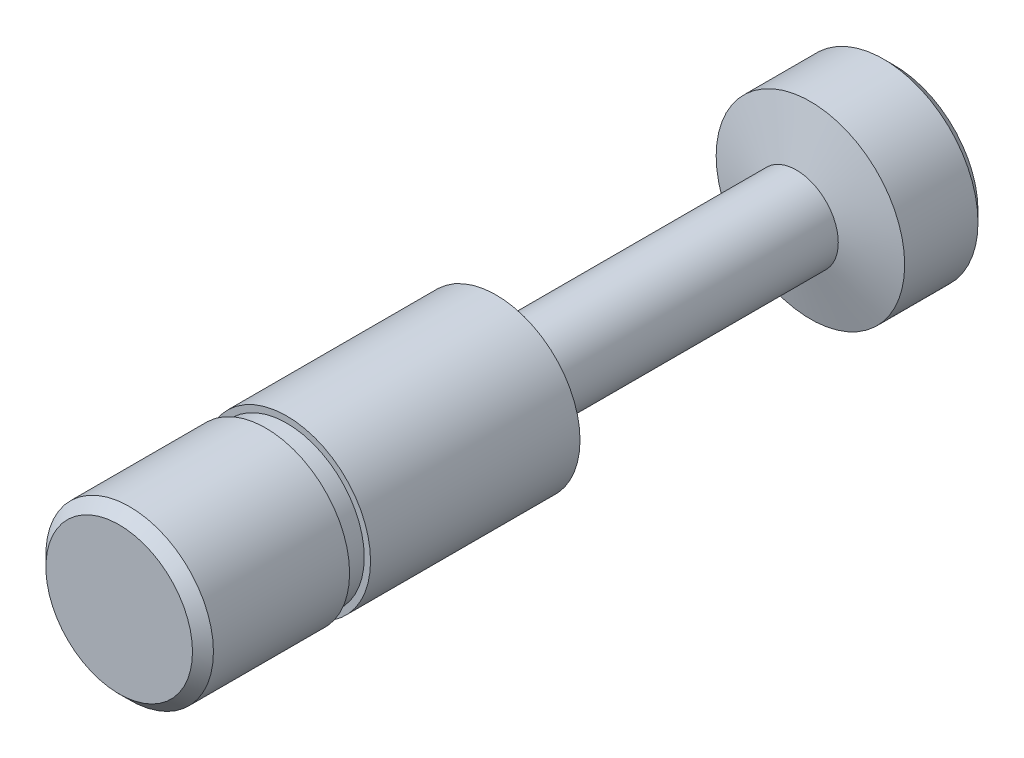
ISO-10303-21;
HEADER;
FILE_DESCRIPTION(('STEP AP214'),'2;1');
FILE_NAME('part.step','',(''),(''),'','','');
FILE_SCHEMA(('AUTOMOTIVE_DESIGN { 1 0 10303 214 1 1 1 1 }'));
ENDSEC;
DATA;
#1=APPLICATION_CONTEXT('core data for automotive mechanical design processes');
#2=APPLICATION_PROTOCOL_DEFINITION('international standard','automotive_design',2000,#1);
#3=PRODUCT_CONTEXT('',#1,'mechanical');
#4=PRODUCT('Part','Part','',(#3));
#5=PRODUCT_RELATED_PRODUCT_CATEGORY('part','',(#4));
#6=PRODUCT_DEFINITION_FORMATION('','',#4);
#7=PRODUCT_DEFINITION_CONTEXT('part definition',#1,'design');
#8=PRODUCT_DEFINITION('design','',#6,#7);
#9=PRODUCT_DEFINITION_SHAPE('','',#8);
#10=(LENGTH_UNIT() NAMED_UNIT(*) SI_UNIT(.MILLI.,.METRE.));
#11=(NAMED_UNIT(*) PLANE_ANGLE_UNIT() SI_UNIT($,.RADIAN.));
#12=(NAMED_UNIT(*) SI_UNIT($,.STERADIAN.) SOLID_ANGLE_UNIT());
#13=UNCERTAINTY_MEASURE_WITH_UNIT(LENGTH_MEASURE(1.E-05),#10,'distance_accuracy_value','');
#14=(GEOMETRIC_REPRESENTATION_CONTEXT(3) GLOBAL_UNCERTAINTY_ASSIGNED_CONTEXT((#13)) GLOBAL_UNIT_ASSIGNED_CONTEXT((#10,
#11,#12)) REPRESENTATION_CONTEXT('',''));
#15=CARTESIAN_POINT('',(0.,0.,0.));
#16=DIRECTION('',(0.,0.,1.));
#17=DIRECTION('',(1.,0.,0.));
#18=AXIS2_PLACEMENT_3D('',#15,#16,#17);
#19=CARTESIAN_POINT('',(0.,0.,-19.15));
#20=DIRECTION('',(0.,0.,1.));
#21=DIRECTION('',(1.,0.,0.));
#22=AXIS2_PLACEMENT_3D('',#19,#20,#21);
#23=CYLINDRICAL_SURFACE('',#22,4.);
#24=CARTESIAN_POINT('',(0.,0.,-18.));
#25=DIRECTION('',(0.,0.,1.));
#26=DIRECTION('',(1.,0.,0.));
#27=AXIS2_PLACEMENT_3D('',#24,#25,#26);
#28=CIRCLE('',#27,4.);
#29=CARTESIAN_POINT('',(4.,0.,-18.));
#30=VERTEX_POINT('',#29);
#31=EDGE_CURVE('E20',#30,#30,#28,.T.);
#32=ORIENTED_EDGE('',*,*,#31,.T.);
#33=EDGE_LOOP('',(#32));
#34=FACE_BOUND('',#33,.T.);
#35=CARTESIAN_POINT('',(0.,0.,-8.));
#36=DIRECTION('',(0.,0.,1.));
#37=DIRECTION('',(1.,0.,0.));
#38=AXIS2_PLACEMENT_3D('',#35,#36,#37);
#39=CIRCLE('',#38,4.);
#40=CARTESIAN_POINT('',(4.,0.,-8.));
#41=VERTEX_POINT('',#40);
#42=EDGE_CURVE('E39',#41,#41,#39,.F.);
#43=ORIENTED_EDGE('',*,*,#42,.T.);
#44=EDGE_LOOP('',(#43));
#45=FACE_BOUND('',#44,.T.);
#46=ADVANCED_FACE('F13',(#34,#45),#23,.T.);
#47=CARTESIAN_POINT('',(0.,0.,-8.));
#48=DIRECTION('',(0.,0.,1.));
#49=DIRECTION('',(1.,0.,0.));
#50=AXIS2_PLACEMENT_3D('',#47,#48,#49);
#51=PLANE('',#50);
#52=ORIENTED_EDGE('',*,*,#42,.F.);
#53=EDGE_LOOP('',(#52));
#54=FACE_BOUND('',#53,.T.);
#55=CARTESIAN_POINT('',(0.,0.,-8.));
#56=DIRECTION('',(0.,0.,1.));
#57=DIRECTION('',(1.,0.,0.));
#58=AXIS2_PLACEMENT_3D('',#55,#56,#57);
#59=CIRCLE('',#58,3.7);
#60=CARTESIAN_POINT('',(3.7,0.,-8.));
#61=VERTEX_POINT('',#60);
#62=EDGE_CURVE('E45',#61,#61,#59,.T.);
#63=ORIENTED_EDGE('',*,*,#62,.F.);
#64=EDGE_LOOP('',(#63));
#65=FACE_BOUND('',#64,.T.);
#66=ADVANCED_FACE('F71',(#54,#65),#51,.T.);
#67=CARTESIAN_POINT('',(0.,0.,-7.));
#68=DIRECTION('',(0.,0.,1.));
#69=DIRECTION('',(1.,0.,0.));
#70=AXIS2_PLACEMENT_3D('',#67,#68,#69);
#71=PLANE('',#70);
#72=CARTESIAN_POINT('',(0.,0.,-7.));
#73=DIRECTION('',(0.,0.,1.));
#74=DIRECTION('',(1.,0.,0.));
#75=AXIS2_PLACEMENT_3D('',#72,#73,#74);
#76=CIRCLE('',#75,4.);
#77=CARTESIAN_POINT('',(4.,0.,-7.));
#78=VERTEX_POINT('',#77);
#79=EDGE_CURVE('E42',#78,#78,#76,.F.);
#80=ORIENTED_EDGE('',*,*,#79,.T.);
#81=EDGE_LOOP('',(#80));
#82=FACE_BOUND('',#81,.T.);
#83=CARTESIAN_POINT('',(0.,0.,-7.));
#84=DIRECTION('',(0.,0.,1.));
#85=DIRECTION('',(1.,0.,0.));
#86=AXIS2_PLACEMENT_3D('',#83,#84,#85);
#87=CIRCLE('',#86,3.7);
#88=CARTESIAN_POINT('',(3.7,0.,-7.));
#89=VERTEX_POINT('',#88);
#90=EDGE_CURVE('E46',#89,#89,#87,.T.);
#91=ORIENTED_EDGE('',*,*,#90,.T.);
#92=EDGE_LOOP('',(#91));
#93=FACE_BOUND('',#92,.T.);
#94=ADVANCED_FACE('F77',(#82,#93),#71,.F.);
#95=CARTESIAN_POINT('',(0.,0.,-8.));
#96=DIRECTION('',(0.,0.,1.));
#97=DIRECTION('',(1.,0.,0.));
#98=AXIS2_PLACEMENT_3D('',#95,#96,#97);
#99=CYLINDRICAL_SURFACE('',#98,3.7);
#100=ORIENTED_EDGE('',*,*,#62,.T.);
#101=EDGE_LOOP('',(#100));
#102=FACE_BOUND('',#101,.T.);
#103=ORIENTED_EDGE('',*,*,#90,.F.);
#104=EDGE_LOOP('',(#103));
#105=FACE_BOUND('',#104,.T.);
#106=ADVANCED_FACE('F92',(#102,#105),#99,.T.);
#107=CARTESIAN_POINT('',(0.,0.,0.));
#108=DIRECTION('',(0.,0.,1.));
#109=DIRECTION('',(1.,0.,0.));
#110=AXIS2_PLACEMENT_3D('',#107,#108,#109);
#111=PLANE('',#110);
#112=CARTESIAN_POINT('',(0.,0.,0.));
#113=DIRECTION('',(0.,0.,1.));
#114=DIRECTION('',(1.,0.,0.));
#115=AXIS2_PLACEMENT_3D('',#112,#113,#114);
#116=CIRCLE('',#115,3.5);
#117=CARTESIAN_POINT('',(3.5,0.,0.));
#118=VERTEX_POINT('',#117);
#119=EDGE_CURVE('E36',#118,#118,#116,.T.);
#120=ORIENTED_EDGE('',*,*,#119,.T.);
#121=EDGE_LOOP('',(#120));
#122=FACE_BOUND('',#121,.T.);
#123=ADVANCED_FACE('F84',(#122),#111,.T.);
#124=CARTESIAN_POINT('',(0.,0.,-0.500000000000004));
#125=DIRECTION('',(0.,0.,1.));
#126=DIRECTION('',(1.,0.,0.));
#127=AXIS2_PLACEMENT_3D('',#124,#125,#126);
#128=CIRCLE('',#127,4.);
#129=CARTESIAN_POINT('',(4.,0.,-0.500000000000004));
#130=VERTEX_POINT('',#129);
#131=EDGE_CURVE('E33',#130,#130,#128,.F.);
#132=ORIENTED_EDGE('',*,*,#131,.T.);
#133=EDGE_LOOP('',(#132));
#134=FACE_BOUND('',#133,.T.);
#135=ORIENTED_EDGE('',*,*,#79,.F.);
#136=EDGE_LOOP('',(#135));
#137=FACE_BOUND('',#136,.T.);
#138=ADVANCED_FACE('F73',(#134,#137),#23,.T.);
#139=CARTESIAN_POINT('',(0.,0.,-32.33));
#140=DIRECTION('',(0.,0.,1.));
#141=DIRECTION('',(1.,0.,0.));
#142=AXIS2_PLACEMENT_3D('',#139,#140,#141);
#143=CYLINDRICAL_SURFACE('',#142,2.);
#144=CARTESIAN_POINT('',(0.,0.,-32.33));
#145=DIRECTION('',(0.,0.,1.));
#146=DIRECTION('',(1.,0.,0.));
#147=AXIS2_PLACEMENT_3D('',#144,#145,#146);
#148=CIRCLE('',#147,2.);
#149=CARTESIAN_POINT('',(2.,0.,-32.33));
#150=VERTEX_POINT('',#149);
#151=EDGE_CURVE('E49',#150,#150,#148,.T.);
#152=ORIENTED_EDGE('',*,*,#151,.T.);
#153=EDGE_LOOP('',(#152));
#154=FACE_BOUND('',#153,.T.);
#155=CARTESIAN_POINT('',(0.,0.,-19.15));
#156=DIRECTION('',(0.,0.,1.));
#157=DIRECTION('',(1.,0.,0.));
#158=AXIS2_PLACEMENT_3D('',#155,#156,#157);
#159=CIRCLE('',#158,2.);
#160=CARTESIAN_POINT('',(2.,0.,-19.15));
#161=VERTEX_POINT('',#160);
#162=EDGE_CURVE('E52',#161,#161,#159,.T.);
#163=ORIENTED_EDGE('',*,*,#162,.F.);
#164=EDGE_LOOP('',(#163));
#165=FACE_BOUND('',#164,.T.);
#166=ADVANCED_FACE('F58',(#154,#165),#143,.T.);
#167=CARTESIAN_POINT('',(0.,0.,-37.));
#168=DIRECTION('',(0.,0.,1.));
#169=DIRECTION('',(1.,0.,0.));
#170=AXIS2_PLACEMENT_3D('',#167,#168,#169);
#171=PLANE('',#170);
#172=CARTESIAN_POINT('',(0.,0.,-37.));
#173=DIRECTION('',(0.,0.,1.));
#174=DIRECTION('',(1.,0.,0.));
#175=AXIS2_PLACEMENT_3D('',#172,#173,#174);
#176=CIRCLE('',#175,4.);
#177=CARTESIAN_POINT('',(4.,0.,-37.));
#178=VERTEX_POINT('',#177);
#179=EDGE_CURVE('E24',#178,#178,#176,.F.);
#180=ORIENTED_EDGE('',*,*,#179,.T.);
#181=EDGE_LOOP('',(#180));
#182=FACE_BOUND('',#181,.T.);
#183=ADVANCED_FACE('F90',(#182),#171,.F.);
#184=CARTESIAN_POINT('',(0.,0.,-37.));
#185=DIRECTION('',(0.,0.,1.));
#186=DIRECTION('',(1.,0.,0.));
#187=AXIS2_PLACEMENT_3D('',#184,#185,#186);
#188=CYLINDRICAL_SURFACE('',#187,4.5);
#189=CARTESIAN_POINT('',(0.,0.,-33.));
#190=DIRECTION('',(0.,0.,1.));
#191=DIRECTION('',(1.,0.,0.));
#192=AXIS2_PLACEMENT_3D('',#189,#190,#191);
#193=CIRCLE('',#192,4.5);
#194=CARTESIAN_POINT('',(4.5,0.,-33.));
#195=VERTEX_POINT('',#194);
#196=EDGE_CURVE('E9',#195,#195,#193,.F.);
#197=ORIENTED_EDGE('',*,*,#196,.T.);
#198=EDGE_LOOP('',(#197));
#199=FACE_BOUND('',#198,.T.);
#200=CARTESIAN_POINT('',(0.,0.,-36.5));
#201=DIRECTION('',(0.,0.,1.));
#202=DIRECTION('',(1.,0.,0.));
#203=AXIS2_PLACEMENT_3D('',#200,#201,#202);
#204=CIRCLE('',#203,4.5);
#205=CARTESIAN_POINT('',(4.5,0.,-36.5));
#206=VERTEX_POINT('',#205);
#207=EDGE_CURVE('E28',#206,#206,#204,.T.);
#208=ORIENTED_EDGE('',*,*,#207,.T.);
#209=EDGE_LOOP('',(#208));
#210=FACE_BOUND('',#209,.T.);
#211=ADVANCED_FACE('F144',(#199,#210),#188,.T.);
#212=CARTESIAN_POINT('',(0.,0.,0.));
#213=DIRECTION('',(0.,0.,-1.));
#214=DIRECTION('',(-1.,0.,0.));
#215=AXIS2_PLACEMENT_3D('',#212,#213,#214);
#216=CONICAL_SURFACE('',#215,3.5,0.785398163397441);
#217=ORIENTED_EDGE('',*,*,#131,.F.);
#218=EDGE_LOOP('',(#217));
#219=FACE_BOUND('',#218,.T.);
#220=ORIENTED_EDGE('',*,*,#119,.F.);
#221=EDGE_LOOP('',(#220));
#222=FACE_BOUND('',#221,.T.);
#223=ADVANCED_FACE('F154',(#219,#222),#216,.T.);
#224=CARTESIAN_POINT('',(0.,0.,-36.5));
#225=DIRECTION('',(0.,0.,1.));
#226=DIRECTION('',(1.,0.,0.));
#227=AXIS2_PLACEMENT_3D('',#224,#225,#226);
#228=CONICAL_SURFACE('',#227,4.5,0.785398163397444);
#229=ORIENTED_EDGE('',*,*,#179,.F.);
#230=EDGE_LOOP('',(#229));
#231=FACE_BOUND('',#230,.T.);
#232=ORIENTED_EDGE('',*,*,#207,.F.);
#233=EDGE_LOOP('',(#232));
#234=FACE_BOUND('',#233,.T.);
#235=ADVANCED_FACE('F68',(#231,#234),#228,.T.);
#236=CARTESIAN_POINT('',(0.,0.,-19.15));
#237=DIRECTION('',(0.,0.,1.));
#238=DIRECTION('',(1.,0.,0.));
#239=AXIS2_PLACEMENT_3D('',#236,#237,#238);
#240=CONICAL_SURFACE('',#239,1.99999999999999,1.04896204698049);
#241=ORIENTED_EDGE('',*,*,#31,.F.);
#242=EDGE_LOOP('',(#241));
#243=FACE_BOUND('',#242,.T.);
#244=ORIENTED_EDGE('',*,*,#162,.T.);
#245=EDGE_LOOP('',(#244));
#246=FACE_BOUND('',#245,.T.);
#247=ADVANCED_FACE('F62',(#243,#246),#240,.T.);
#248=CARTESIAN_POINT('',(0.,0.,-32.33));
#249=DIRECTION('',(0.,0.,-1.));
#250=DIRECTION('',(-1.,0.,0.));
#251=AXIS2_PLACEMENT_3D('',#248,#249,#250);
#252=CONICAL_SURFACE('',#251,1.99999999999998,1.30894953549079);
#253=ORIENTED_EDGE('',*,*,#196,.F.);
#254=EDGE_LOOP('',(#253));
#255=FACE_BOUND('',#254,.T.);
#256=ORIENTED_EDGE('',*,*,#151,.F.);
#257=EDGE_LOOP('',(#256));
#258=FACE_BOUND('',#257,.T.);
#259=ADVANCED_FACE('F15',(#255,#258),#252,.T.);
#260=CLOSED_SHELL('',(#46,#66,#94,#106,#123,#138,#166,#183,#211,#223,#235,#247,#259));
#261=MANIFOLD_SOLID_BREP('B1',#260);
#262=ADVANCED_BREP_SHAPE_REPRESENTATION('',(#18,#261),#14);
#263=SHAPE_DEFINITION_REPRESENTATION(#9,#262);
ENDSEC;
END-ISO-10303-21;
